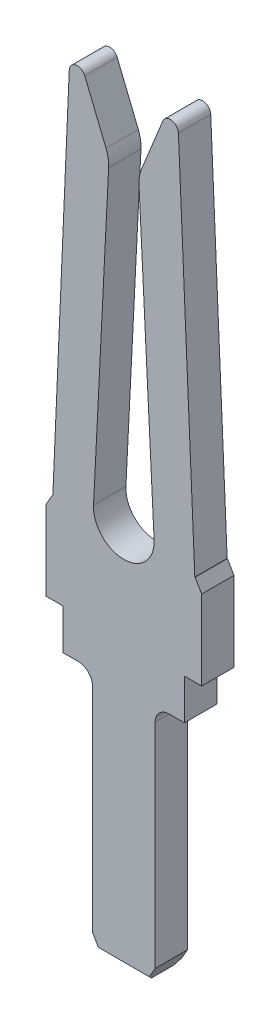
ISO-10303-21;
HEADER;
FILE_DESCRIPTION(('STEP AP214'),'2;1');
FILE_NAME('part.step','',(''),(''),'','','');
FILE_SCHEMA(('AUTOMOTIVE_DESIGN { 1 0 10303 214 1 1 1 1 }'));
ENDSEC;
DATA;
#1=APPLICATION_CONTEXT('core data for automotive mechanical design processes');
#2=APPLICATION_PROTOCOL_DEFINITION('international standard','automotive_design',2000,#1);
#3=PRODUCT_CONTEXT('',#1,'mechanical');
#4=PRODUCT('Part','Part','',(#3));
#5=PRODUCT_RELATED_PRODUCT_CATEGORY('part','',(#4));
#6=PRODUCT_DEFINITION_FORMATION('','',#4);
#7=PRODUCT_DEFINITION_CONTEXT('part definition',#1,'design');
#8=PRODUCT_DEFINITION('design','',#6,#7);
#9=PRODUCT_DEFINITION_SHAPE('','',#8);
#10=(LENGTH_UNIT() NAMED_UNIT(*) SI_UNIT(.MILLI.,.METRE.));
#11=(NAMED_UNIT(*) PLANE_ANGLE_UNIT() SI_UNIT($,.RADIAN.));
#12=(NAMED_UNIT(*) SI_UNIT($,.STERADIAN.) SOLID_ANGLE_UNIT());
#13=UNCERTAINTY_MEASURE_WITH_UNIT(LENGTH_MEASURE(1.E-05),#10,'distance_accuracy_value','');
#14=(GEOMETRIC_REPRESENTATION_CONTEXT(3) GLOBAL_UNCERTAINTY_ASSIGNED_CONTEXT((#13)) GLOBAL_UNIT_ASSIGNED_CONTEXT((#10,
#11,#12)) REPRESENTATION_CONTEXT('',''));
#15=CARTESIAN_POINT('',(0.,0.,0.));
#16=DIRECTION('',(0.,0.,1.));
#17=DIRECTION('',(1.,0.,0.));
#18=AXIS2_PLACEMENT_3D('',#15,#16,#17);
#19=CARTESIAN_POINT('',(0.,-3.048,0.));
#20=DIRECTION('',(0.,1.,0.));
#21=DIRECTION('',(0.,0.,1.));
#22=AXIS2_PLACEMENT_3D('',#19,#20,#21);
#23=PLANE('',#22);
#24=DIRECTION('',(1.,0.,0.));
#25=VECTOR('',#24,1.);
#26=CARTESIAN_POINT('',(0.,-3.04799999964588,-0.139700000354116));
#27=LINE('',#26,#25);
#28=CARTESIAN_POINT('',(-0.283714775017793,-3.04799999917373,-0.139700000118038));
#29=VERTEX_POINT('',#28);
#30=CARTESIAN_POINT('',(0.283714774813344,-3.04799999917373,-0.139700000295097));
#31=VERTEX_POINT('',#30);
#32=EDGE_CURVE('E177',#29,#31,#27,.T.);
#33=ORIENTED_EDGE('',*,*,#32,.T.);
#34=DIRECTION('',(0.,0.,1.));
#35=VECTOR('',#34,1.);
#36=CARTESIAN_POINT('',(0.283714774813344,-3.04799999893765,0.));
#37=LINE('',#36,#35);
#38=CARTESIAN_POINT('',(0.283714775017793,-3.04799999917373,0.139700000118039));
#39=VERTEX_POINT('',#38);
#40=EDGE_CURVE('E340',#39,#31,#37,.F.);
#41=ORIENTED_EDGE('',*,*,#40,.F.);
#42=DIRECTION('',(1.,0.,0.));
#43=VECTOR('',#42,1.);
#44=CARTESIAN_POINT('',(0.,-3.04799999964588,0.139700000354116));
#45=LINE('',#44,#43);
#46=CARTESIAN_POINT('',(-0.28371477569929,-3.04799999940981,0.139700000354116));
#47=VERTEX_POINT('',#46);
#48=EDGE_CURVE('E186',#39,#47,#45,.F.);
#49=ORIENTED_EDGE('',*,*,#48,.T.);
#50=DIRECTION('',(0.,0.,1.));
#51=VECTOR('',#50,1.);
#52=CARTESIAN_POINT('',(-0.283714774813343,-3.04799999893765,0.));
#53=LINE('',#52,#51);
#54=EDGE_CURVE('E356',#47,#29,#53,.F.);
#55=ORIENTED_EDGE('',*,*,#54,.T.);
#56=EDGE_LOOP('',(#33,#41,#49,#55));
#57=FACE_BOUND('',#56,.T.);
#58=ADVANCED_FACE('F16',(#57),#23,.F.);
#59=CARTESIAN_POINT('',(0.,-3.01625,-0.17145));
#60=DIRECTION('',(0.,0.707106781186548,0.707106781186548));
#61=DIRECTION('',(0.,-0.707106781186548,0.707106781186548));
#62=AXIS2_PLACEMENT_3D('',#59,#60,#61);
#63=PLANE('',#62);
#64=ORIENTED_EDGE('',*,*,#32,.F.);
#65=DIRECTION('',(-0.377964471826341,0.654653671519875,-0.654653670579019));
#66=VECTOR('',#65,1.);
#67=CARTESIAN_POINT('',(-0.283714774813344,-3.04799999893765,-0.1397));
#68=LINE('',#67,#66);
#69=CARTESIAN_POINT('',(-0.320376517025292,-2.98449999897683,-0.2032));
#70=VERTEX_POINT('',#69);
#71=EDGE_CURVE('E358',#29,#70,#68,.T.);
#72=ORIENTED_EDGE('',*,*,#71,.T.);
#73=DIRECTION('',(1.,0.,0.));
#74=VECTOR('',#73,1.);
#75=CARTESIAN_POINT('',(0.,-2.9844999992377,-0.2032));
#76=LINE('',#75,#74);
#77=CARTESIAN_POINT('',(0.320376516629927,-2.98449999917248,-0.2032));
#78=VERTEX_POINT('',#77);
#79=EDGE_CURVE('E262',#70,#78,#76,.T.);
#80=ORIENTED_EDGE('',*,*,#79,.T.);
#81=DIRECTION('',(0.377964471755182,0.654653671396623,-0.654653670743355));
#82=VECTOR('',#81,1.);
#83=CARTESIAN_POINT('',(0.283714774660007,-3.04799999920324,-0.1397));
#84=LINE('',#83,#82);
#85=EDGE_CURVE('E332',#31,#78,#84,.T.);
#86=ORIENTED_EDGE('',*,*,#85,.F.);
#87=EDGE_LOOP('',(#64,#72,#80,#86));
#88=FACE_BOUND('',#87,.T.);
#89=ADVANCED_FACE('F937',(#88),#63,.F.);
#90=CARTESIAN_POINT('',(0.,1.74640488931151,-0.2032));
#91=DIRECTION('',(0.,0.,1.));
#92=DIRECTION('',(1.,0.,0.));
#93=AXIS2_PLACEMENT_3D('',#90,#91,#92);
#94=PLANE('',#93);
#95=DIRECTION('',(1.,0.,0.));
#96=VECTOR('',#95,1.);
#97=CARTESIAN_POINT('',(-0.8938587533,1.651,-0.2032));
#98=LINE('',#97,#96);
#99=CARTESIAN_POINT('',(-0.892048000003553,1.65099999940063,-0.2032));
#100=VERTEX_POINT('',#99);
#101=CARTESIAN_POINT('',(-0.895669507755047,1.65099999883827,-0.2032));
#102=VERTEX_POINT('',#101);
#103=EDGE_CURVE('E259',#100,#102,#98,.F.);
#104=ORIENTED_EDGE('',*,*,#103,.F.);
#105=DIRECTION('',(0.0435939688754908,0.999049331053118,0.));
#106=VECTOR('',#105,1.);
#107=CARTESIAN_POINT('',(-0.7888757019,4.0154145752,-0.2032));
#108=LINE('',#107,#106);
#109=CARTESIAN_POINT('',(-0.685703403955362,6.37982914683937,-0.2032));
#110=VERTEX_POINT('',#109);
#111=EDGE_CURVE('E254',#100,#110,#108,.T.);
#112=ORIENTED_EDGE('',*,*,#111,.T.);
#113=CARTESIAN_POINT('',(-0.5842,6.3754,-0.2032));
#114=DIRECTION('',(0.,0.,-1.));
#115=DIRECTION('',(-1.,0.,0.));
#116=AXIS2_PLACEMENT_3D('',#113,#114,#115);
#117=CIRCLE('',#116,0.1016);
#118=CARTESIAN_POINT('',(-0.490093234634906,6.4136946169262,-0.2032));
#119=VERTEX_POINT('',#118);
#120=EDGE_CURVE('E413',#119,#110,#117,.F.);
#121=ORIENTED_EDGE('',*,*,#120,.F.);
#122=DIRECTION('',(-0.376915510328809,0.926247644031322,0.));
#123=VECTOR('',#122,1.);
#124=CARTESIAN_POINT('',(-0.3571563977,6.0870101907,-0.2032));
#125=LINE('',#124,#123);
#126=CARTESIAN_POINT('',(-0.224219569838039,5.76032577406583,-0.2032));
#127=VERTEX_POINT('',#126);
#128=EDGE_CURVE('E265',#127,#119,#125,.T.);
#129=ORIENTED_EDGE('',*,*,#128,.F.);
#130=CARTESIAN_POINT('',(-0.6477,5.588,-0.2032));
#131=DIRECTION('',(0.,0.,-1.));
#132=DIRECTION('',(-1.,0.,0.));
#133=AXIS2_PLACEMENT_3D('',#130,#131,#132);
#134=CIRCLE('',#133,0.4572);
#135=CARTESIAN_POINT('',(-0.191076780215661,5.56504194898683,-0.2032));
#136=VERTEX_POINT('',#135);
#137=EDGE_CURVE('E415',#136,#127,#134,.F.);
#138=ORIENTED_EDGE('',*,*,#137,.F.);
#139=DIRECTION('',(0.0502144612300115,0.998738458197831,0.));
#140=VECTOR('',#139,1.);
#141=CARTESIAN_POINT('',(-0.2857980695,3.6810868339,-0.2032));
#142=LINE('',#141,#140);
#143=CARTESIAN_POINT('',(-0.380519355868454,1.79713171043837,-0.2032));
#144=VERTEX_POINT('',#143);
#145=EDGE_CURVE('E269',#144,#136,#142,.T.);
#146=ORIENTED_EDGE('',*,*,#145,.F.);
#147=CARTESIAN_POINT('',(0.,1.778,-0.2032));
#148=DIRECTION('',(0.,0.,1.));
#149=DIRECTION('',(1.,0.,0.));
#150=AXIS2_PLACEMENT_3D('',#147,#148,#149);
#151=CIRCLE('',#150,0.381);
#152=CARTESIAN_POINT('',(0.38051935421113,1.7971317102781,-0.2032));
#153=VERTEX_POINT('',#152);
#154=EDGE_CURVE('E417',#144,#153,#151,.T.);
#155=ORIENTED_EDGE('',*,*,#154,.T.);
#156=DIRECTION('',(-0.0502144612300115,0.998738458197831,0.));
#157=VECTOR('',#156,1.);
#158=CARTESIAN_POINT('',(0.2857980695,3.6810868339,-0.2032));
#159=LINE('',#158,#157);
#160=CARTESIAN_POINT('',(0.191076783539906,5.56504194923955,-0.2032));
#161=VERTEX_POINT('',#160);
#162=EDGE_CURVE('E273',#153,#161,#159,.T.);
#163=ORIENTED_EDGE('',*,*,#162,.T.);
#164=CARTESIAN_POINT('',(0.6477,5.588,-0.2032));
#165=DIRECTION('',(0.,0.,-1.));
#166=DIRECTION('',(-1.,0.,0.));
#167=AXIS2_PLACEMENT_3D('',#164,#165,#166);
#168=CIRCLE('',#167,0.4572);
#169=CARTESIAN_POINT('',(0.224219573564484,5.76032577286862,-0.2032));
#170=VERTEX_POINT('',#169);
#171=EDGE_CURVE('E276',#170,#161,#168,.F.);
#172=ORIENTED_EDGE('',*,*,#171,.F.);
#173=DIRECTION('',(0.376915510328809,0.926247644031322,0.));
#174=VECTOR('',#173,1.);
#175=CARTESIAN_POINT('',(0.3571563977,6.0870101907,-0.2032));
#176=LINE('',#175,#174);
#177=CARTESIAN_POINT('',(0.490093230090947,6.41369461846389,-0.2032));
#178=VERTEX_POINT('',#177);
#179=EDGE_CURVE('E277',#170,#178,#176,.T.);
#180=ORIENTED_EDGE('',*,*,#179,.T.);
#181=CARTESIAN_POINT('',(0.5842,6.3754,-0.2032));
#182=DIRECTION('',(0.,0.,-1.));
#183=DIRECTION('',(-1.,0.,0.));
#184=AXIS2_PLACEMENT_3D('',#181,#182,#183);
#185=CIRCLE('',#184,0.1016);
#186=CARTESIAN_POINT('',(0.685703407984071,6.37982914729314,-0.2032));
#187=VERTEX_POINT('',#186);
#188=EDGE_CURVE('E280',#187,#178,#185,.F.);
#189=ORIENTED_EDGE('',*,*,#188,.F.);
#190=DIRECTION('',(-0.0435939688754908,0.999049331053118,0.));
#191=VECTOR('',#190,1.);
#192=CARTESIAN_POINT('',(0.7888757019,4.0154145752,-0.2032));
#193=LINE('',#192,#191);
#194=CARTESIAN_POINT('',(0.892048000058918,1.65099999909995,-0.2032));
#195=VERTEX_POINT('',#194);
#196=EDGE_CURVE('E281',#195,#187,#193,.T.);
#197=ORIENTED_EDGE('',*,*,#196,.F.);
#198=DIRECTION('',(1.,0.,0.));
#199=VECTOR('',#198,1.);
#200=CARTESIAN_POINT('',(0.8938587533,1.651,-0.2032));
#201=LINE('',#200,#199);
#202=CARTESIAN_POINT('',(0.895669507857299,1.65099999975803,-0.2032));
#203=VERTEX_POINT('',#202);
#204=EDGE_CURVE('E287',#203,#195,#201,.F.);
#205=ORIENTED_EDGE('',*,*,#204,.F.);
#206=DIRECTION('',(-0.500000043970481,0.866025378398068,0.));
#207=VECTOR('',#206,1.);
#208=CARTESIAN_POINT('',(0.9367847533,1.5797863121,-0.2032));
#209=LINE('',#208,#207);
#210=CARTESIAN_POINT('',(0.977900001395054,1.50857262057555,-0.2032));
#211=VERTEX_POINT('',#210);
#212=EDGE_CURVE('E294',#211,#203,#209,.T.);
#213=ORIENTED_EDGE('',*,*,#212,.F.);
#214=DIRECTION('',(0.,1.,0.));
#215=VECTOR('',#214,1.);
#216=CARTESIAN_POINT('',(0.9779,1.0082863121,-0.2032));
#217=LINE('',#216,#215);
#218=CARTESIAN_POINT('',(0.9779,0.50800000024638,-0.2032));
#219=VERTEX_POINT('',#218);
#220=EDGE_CURVE('E297',#219,#211,#217,.T.);
#221=ORIENTED_EDGE('',*,*,#220,.F.);
#222=DIRECTION('',(1.,0.,0.));
#223=VECTOR('',#222,1.);
#224=CARTESIAN_POINT('',(0.86995,0.508,-0.2032));
#225=LINE('',#224,#223);
#226=CARTESIAN_POINT('',(0.762000000112889,0.508,-0.2032));
#227=VERTEX_POINT('',#226);
#228=EDGE_CURVE('E305',#219,#227,#225,.F.);
#229=ORIENTED_EDGE('',*,*,#228,.T.);
#230=DIRECTION('',(0.,1.,0.));
#231=VECTOR('',#230,1.);
#232=CARTESIAN_POINT('',(0.762,0.254,-0.2032));
#233=LINE('',#232,#231);
#234=CARTESIAN_POINT('',(0.762,2.87393553688916E-10,-0.2032));
#235=VERTEX_POINT('',#234);
#236=EDGE_CURVE('E312',#235,#227,#233,.T.);
#237=ORIENTED_EDGE('',*,*,#236,.F.);
#238=DIRECTION('',(1.,0.,0.));
#239=VECTOR('',#238,1.);
#240=CARTESIAN_POINT('',(0.66675,0.,-0.2032));
#241=LINE('',#240,#239);
#242=CARTESIAN_POINT('',(0.571499999969202,0.,-0.2032));
#243=VERTEX_POINT('',#242);
#244=EDGE_CURVE('E318',#235,#243,#241,.F.);
#245=ORIENTED_EDGE('',*,*,#244,.T.);
#246=CARTESIAN_POINT('',(0.5715,-0.1778,-0.2032));
#247=DIRECTION('',(0.,0.,-1.));
#248=DIRECTION('',(-1.,0.,0.));
#249=AXIS2_PLACEMENT_3D('',#246,#247,#248);
#250=CIRCLE('',#249,0.1778);
#251=CARTESIAN_POINT('',(0.3937,-0.1778,-0.2032));
#252=VERTEX_POINT('',#251);
#253=EDGE_CURVE('E424',#243,#252,#250,.F.);
#254=ORIENTED_EDGE('',*,*,#253,.T.);
#255=DIRECTION('',(0.,1.,0.));
#256=VECTOR('',#255,1.);
#257=CARTESIAN_POINT('',(0.3937,-1.51765,-0.2032));
#258=LINE('',#257,#256);
#259=CARTESIAN_POINT('',(0.393700000226937,-2.85749999855876,-0.2032));
#260=VERTEX_POINT('',#259);
#261=EDGE_CURVE('E323',#260,#252,#258,.T.);
#262=ORIENTED_EDGE('',*,*,#261,.F.);
#263=DIRECTION('',(0.499999998361318,0.866025404730532,0.));
#264=VECTOR('',#263,1.);
#265=CARTESIAN_POINT('',(0.3387073871,-2.95275,-0.2032));
#266=LINE('',#265,#264);
#267=EDGE_CURVE('E327',#78,#260,#266,.T.);
#268=ORIENTED_EDGE('',*,*,#267,.F.);
#269=ORIENTED_EDGE('',*,*,#79,.F.);
#270=DIRECTION('',(-0.499999998361318,0.866025404730532,0.));
#271=VECTOR('',#270,1.);
#272=CARTESIAN_POINT('',(-0.3387073871,-2.95275,-0.2032));
#273=LINE('',#272,#271);
#274=CARTESIAN_POINT('',(-0.393700000386288,-2.8574999989964,-0.2032));
#275=VERTEX_POINT('',#274);
#276=EDGE_CURVE('E366',#70,#275,#273,.T.);
#277=ORIENTED_EDGE('',*,*,#276,.T.);
#278=DIRECTION('',(0.,1.,0.));
#279=VECTOR('',#278,1.);
#280=CARTESIAN_POINT('',(-0.3937,-1.51765,-0.2032));
#281=LINE('',#280,#279);
#282=CARTESIAN_POINT('',(-0.3937,-0.177800000289516,-0.2032));
#283=VERTEX_POINT('',#282);
#284=EDGE_CURVE('E128',#275,#283,#281,.T.);
#285=ORIENTED_EDGE('',*,*,#284,.T.);
#286=CARTESIAN_POINT('',(-0.5715,-0.1778,-0.2032));
#287=DIRECTION('',(0.,0.,-1.));
#288=DIRECTION('',(-1.,0.,0.));
#289=AXIS2_PLACEMENT_3D('',#286,#287,#288);
#290=CIRCLE('',#289,0.1778);
#291=CARTESIAN_POINT('',(-0.571499999963107,0.,-0.2032));
#292=VERTEX_POINT('',#291);
#293=EDGE_CURVE('E19',#283,#292,#290,.F.);
#294=ORIENTED_EDGE('',*,*,#293,.T.);
#295=DIRECTION('',(1.,0.,0.));
#296=VECTOR('',#295,1.);
#297=CARTESIAN_POINT('',(-0.66675,0.,-0.2032));
#298=LINE('',#297,#296);
#299=CARTESIAN_POINT('',(-0.762000000112889,0.,-0.2032));
#300=VERTEX_POINT('',#299);
#301=EDGE_CURVE('E138',#292,#300,#298,.F.);
#302=ORIENTED_EDGE('',*,*,#301,.T.);
#303=DIRECTION('',(0.,1.,0.));
#304=VECTOR('',#303,1.);
#305=CARTESIAN_POINT('',(-0.762,0.254,-0.2032));
#306=LINE('',#305,#304);
#307=CARTESIAN_POINT('',(-0.762,0.508000000164253,-0.2032));
#308=VERTEX_POINT('',#307);
#309=EDGE_CURVE('E212',#300,#308,#306,.T.);
#310=ORIENTED_EDGE('',*,*,#309,.T.);
#311=DIRECTION('',(1.,0.,0.));
#312=VECTOR('',#311,1.);
#313=CARTESIAN_POINT('',(-0.86995,0.508,-0.2032));
#314=LINE('',#313,#312);
#315=CARTESIAN_POINT('',(-0.9779,0.508,-0.2032));
#316=VERTEX_POINT('',#315);
#317=EDGE_CURVE('E211',#308,#316,#314,.F.);
#318=ORIENTED_EDGE('',*,*,#317,.T.);
#319=DIRECTION('',(0.,1.,0.));
#320=VECTOR('',#319,1.);
#321=CARTESIAN_POINT('',(-0.9779,1.0082863121,-0.2032));
#322=LINE('',#321,#320);
#323=CARTESIAN_POINT('',(-0.977900000581273,1.50857262050843,-0.2032));
#324=VERTEX_POINT('',#323);
#325=EDGE_CURVE('E242',#316,#324,#322,.T.);
#326=ORIENTED_EDGE('',*,*,#325,.T.);
#327=DIRECTION('',(0.500000043970481,0.866025378398068,0.));
#328=VECTOR('',#327,1.);
#329=CARTESIAN_POINT('',(-0.9367847533,1.5797863121,-0.2032));
#330=LINE('',#329,#328);
#331=EDGE_CURVE('E251',#324,#102,#330,.T.);
#332=ORIENTED_EDGE('',*,*,#331,.T.);
#333=EDGE_LOOP('',(#104,#112,#121,#129,#138,#146,#155,#163,#172,#180,#189,#197,#205,#213,#221,
#229,#237,#245,#254,#262,#268,#269,#277,#285,#294,#302,#310,#318,#326,#332));
#334=FACE_BOUND('',#333,.T.);
#335=ADVANCED_FACE('F640',(#334),#94,.F.);
#336=CARTESIAN_POINT('',(-0.8938587533,1.651,0.));
#337=DIRECTION('',(0.,1.,0.));
#338=DIRECTION('',(0.,0.,1.));
#339=AXIS2_PLACEMENT_3D('',#336,#337,#338);
#340=PLANE('',#339);
#341=DIRECTION('',(1.,0.,0.));
#342=VECTOR('',#341,1.);
#343=CARTESIAN_POINT('',(0.,1.65099999909627,0.2032));
#344=LINE('',#343,#342);
#345=CARTESIAN_POINT('',(-0.892047999967868,1.65099999909782,0.2032));
#346=VERTEX_POINT('',#345);
#347=CARTESIAN_POINT('',(-0.895669507990967,1.65099999881664,0.2032));
#348=VERTEX_POINT('',#347);
#349=EDGE_CURVE('E246',#346,#348,#344,.F.);
#350=ORIENTED_EDGE('',*,*,#349,.F.);
#351=DIRECTION('',(0.,0.,1.));
#352=VECTOR('',#351,1.);
#353=CARTESIAN_POINT('',(-0.892048000039238,1.65099999910094,0.));
#354=LINE('',#353,#352);
#355=EDGE_CURVE('E256',#346,#100,#354,.F.);
#356=ORIENTED_EDGE('',*,*,#355,.T.);
#357=ORIENTED_EDGE('',*,*,#103,.T.);
#358=DIRECTION('',(0.,0.,1.));
#359=VECTOR('',#358,1.);
#360=CARTESIAN_POINT('',(-0.895669507606089,1.6509999982574,0.));
#361=LINE('',#360,#359);
#362=EDGE_CURVE('E249',#102,#348,#361,.T.);
#363=ORIENTED_EDGE('',*,*,#362,.T.);
#364=EDGE_LOOP('',(#350,#356,#357,#363));
#365=FACE_BOUND('',#364,.T.);
#366=ADVANCED_FACE('F626',(#365),#340,.T.);
#367=CARTESIAN_POINT('',(-0.9367847533,1.5797863121,0.));
#368=DIRECTION('',(0.866025378398068,-0.500000043970481,0.));
#369=DIRECTION('',(0.500000043970481,0.866025378398068,0.));
#370=AXIS2_PLACEMENT_3D('',#367,#368,#369);
#371=PLANE('',#370);
#372=ORIENTED_EDGE('',*,*,#331,.F.);
#373=DIRECTION('',(0.,0.,-1.));
#374=VECTOR('',#373,1.);
#375=CARTESIAN_POINT('',(-0.9779,1.50857262017283,0.));
#376=LINE('',#375,#374);
#377=CARTESIAN_POINT('',(-0.977900000406891,1.50857262013927,0.2032));
#378=VERTEX_POINT('',#377);
#379=EDGE_CURVE('E240',#324,#378,#376,.F.);
#380=ORIENTED_EDGE('',*,*,#379,.T.);
#381=DIRECTION('',(-0.500000031176611,-0.866025385784614,0.));
#382=VECTOR('',#381,1.);
#383=CARTESIAN_POINT('',(-0.895669508108822,1.65099999922545,0.2032));
#384=LINE('',#383,#382);
#385=EDGE_CURVE('E227',#348,#378,#384,.T.);
#386=ORIENTED_EDGE('',*,*,#385,.F.);
#387=ORIENTED_EDGE('',*,*,#362,.F.);
#388=EDGE_LOOP('',(#372,#380,#386,#387));
#389=FACE_BOUND('',#388,.T.);
#390=ADVANCED_FACE('F643',(#389),#371,.F.);
#391=CARTESIAN_POINT('',(-0.9779,1.0082863121,0.));
#392=DIRECTION('',(1.,0.,0.));
#393=DIRECTION('',(0.,0.,-1.));
#394=AXIS2_PLACEMENT_3D('',#391,#392,#393);
#395=PLANE('',#394);
#396=DIRECTION('',(0.,1.,0.));
#397=VECTOR('',#396,1.);
#398=CARTESIAN_POINT('',(-0.977900000610336,1.74640488931151,0.2032));
#399=LINE('',#398,#397);
#400=CARTESIAN_POINT('',(-0.977900000406891,0.508000000164253,0.2032));
#401=VERTEX_POINT('',#400);
#402=EDGE_CURVE('E225',#378,#401,#399,.F.);
#403=ORIENTED_EDGE('',*,*,#402,.F.);
#404=ORIENTED_EDGE('',*,*,#379,.F.);
#405=ORIENTED_EDGE('',*,*,#325,.F.);
#406=DIRECTION('',(0.,0.,1.));
#407=VECTOR('',#406,1.);
#408=CARTESIAN_POINT('',(-0.9779,0.508,0.));
#409=LINE('',#408,#407);
#410=EDGE_CURVE('E234',#316,#401,#409,.T.);
#411=ORIENTED_EDGE('',*,*,#410,.T.);
#412=EDGE_LOOP('',(#403,#404,#405,#411));
#413=FACE_BOUND('',#412,.T.);
#414=ADVANCED_FACE('F647',(#413),#395,.F.);
#415=CARTESIAN_POINT('',(-0.86995,0.508,0.));
#416=DIRECTION('',(0.,1.,0.));
#417=DIRECTION('',(0.,0.,1.));
#418=AXIS2_PLACEMENT_3D('',#415,#416,#417);
#419=PLANE('',#418);
#420=ORIENTED_EDGE('',*,*,#317,.F.);
#421=DIRECTION('',(0.,0.,-1.));
#422=VECTOR('',#421,1.);
#423=CARTESIAN_POINT('',(-0.762,0.50800000024638,0.));
#424=LINE('',#423,#422);
#425=CARTESIAN_POINT('',(-0.762000000112889,0.50800000024638,0.2032));
#426=VERTEX_POINT('',#425);
#427=EDGE_CURVE('E205',#308,#426,#424,.F.);
#428=ORIENTED_EDGE('',*,*,#427,.T.);
#429=DIRECTION('',(1.,0.,0.));
#430=VECTOR('',#429,1.);
#431=CARTESIAN_POINT('',(0.,0.50800000024638,0.2032));
#432=LINE('',#431,#430);
#433=EDGE_CURVE('E209',#401,#426,#432,.T.);
#434=ORIENTED_EDGE('',*,*,#433,.F.);
#435=ORIENTED_EDGE('',*,*,#410,.F.);
#436=EDGE_LOOP('',(#420,#428,#434,#435));
#437=FACE_BOUND('',#436,.T.);
#438=ADVANCED_FACE('F206',(#437),#419,.F.);
#439=CARTESIAN_POINT('',(-0.762,0.254,0.));
#440=DIRECTION('',(1.,0.,0.));
#441=DIRECTION('',(0.,0.,-1.));
#442=AXIS2_PLACEMENT_3D('',#439,#440,#441);
#443=PLANE('',#442);
#444=ORIENTED_EDGE('',*,*,#309,.F.);
#445=DIRECTION('',(0.,0.,1.));
#446=VECTOR('',#445,1.);
#447=CARTESIAN_POINT('',(-0.762000000169333,0.,0.));
#448=LINE('',#447,#446);
#449=CARTESIAN_POINT('',(-0.762000000169333,1.91595726552659E-10,0.2032));
#450=VERTEX_POINT('',#449);
#451=EDGE_CURVE('E198',#300,#450,#448,.T.);
#452=ORIENTED_EDGE('',*,*,#451,.T.);
#453=DIRECTION('',(0.,1.,0.));
#454=VECTOR('',#453,1.);
#455=CARTESIAN_POINT('',(-0.762000000169333,1.74640488931151,0.2032));
#456=LINE('',#455,#454);
#457=EDGE_CURVE('E215',#426,#450,#456,.F.);
#458=ORIENTED_EDGE('',*,*,#457,.F.);
#459=ORIENTED_EDGE('',*,*,#427,.F.);
#460=EDGE_LOOP('',(#444,#452,#458,#459));
#461=FACE_BOUND('',#460,.T.);
#462=ADVANCED_FACE('F216',(#461),#443,.F.);
#463=CARTESIAN_POINT('',(-0.66675,0.,0.));
#464=DIRECTION('',(0.,1.,0.));
#465=DIRECTION('',(0.,0.,1.));
#466=AXIS2_PLACEMENT_3D('',#463,#464,#465);
#467=PLANE('',#466);
#468=DIRECTION('',(1.,0.,0.));
#469=VECTOR('',#468,1.);
#470=CARTESIAN_POINT('',(0.,2.87393589828988E-10,0.2032));
#471=LINE('',#470,#469);
#472=CARTESIAN_POINT('',(-0.571499999963107,1.43696794914494E-10,0.2032));
#473=VERTEX_POINT('',#472);
#474=EDGE_CURVE('E219',#450,#473,#471,.T.);
#475=ORIENTED_EDGE('',*,*,#474,.F.);
#476=ORIENTED_EDGE('',*,*,#451,.F.);
#477=ORIENTED_EDGE('',*,*,#301,.F.);
#478=DIRECTION('',(0.,0.,-1.));
#479=VECTOR('',#478,1.);
#480=CARTESIAN_POINT('',(-0.571499999926213,0.,0.2032));
#481=LINE('',#480,#479);
#482=EDGE_CURVE('E363',#292,#473,#481,.F.);
#483=ORIENTED_EDGE('',*,*,#482,.T.);
#484=EDGE_LOOP('',(#475,#476,#477,#483));
#485=FACE_BOUND('',#484,.T.);
#486=ADVANCED_FACE('F472',(#485),#467,.F.);
#487=CARTESIAN_POINT('',(-0.5715,-0.1778,0.2032));
#488=DIRECTION('',(0.,0.,-1.));
#489=DIRECTION('',(-1.,0.,0.));
#490=AXIS2_PLACEMENT_3D('',#487,#488,#489);
#491=CYLINDRICAL_SURFACE('',#490,0.1778);
#492=ORIENTED_EDGE('',*,*,#293,.F.);
#493=DIRECTION('',(0.,0.,-1.));
#494=VECTOR('',#493,1.);
#495=CARTESIAN_POINT('',(-0.3937,-0.177800000579031,0.));
#496=LINE('',#495,#494);
#497=CARTESIAN_POINT('',(-0.393699999951295,-0.177800000289516,0.2032));
#498=VERTEX_POINT('',#497);
#499=EDGE_CURVE('E359',#283,#498,#496,.F.);
#500=ORIENTED_EDGE('',*,*,#499,.T.);
#501=CARTESIAN_POINT('',(-0.5715,-0.1778,0.2032));
#502=DIRECTION('',(0.,0.,-1.));
#503=DIRECTION('',(-1.,0.,0.));
#504=AXIS2_PLACEMENT_3D('',#501,#502,#503);
#505=CIRCLE('',#504,0.1778);
#506=EDGE_CURVE('E409',#473,#498,#505,.T.);
#507=ORIENTED_EDGE('',*,*,#506,.F.);
#508=ORIENTED_EDGE('',*,*,#482,.F.);
#509=EDGE_LOOP('',(#492,#500,#507,#508));
#510=FACE_BOUND('',#509,.T.);
#511=ADVANCED_FACE('F474',(#510),#491,.F.);
#512=CARTESIAN_POINT('',(-0.3937,-1.51765,0.));
#513=DIRECTION('',(1.,0.,0.));
#514=DIRECTION('',(0.,0.,-1.));
#515=AXIS2_PLACEMENT_3D('',#512,#513,#514);
#516=PLANE('',#515);
#517=DIRECTION('',(0.,1.,0.));
#518=VECTOR('',#517,1.);
#519=CARTESIAN_POINT('',(-0.393699999902591,1.74640488931151,0.2032));
#520=LINE('',#519,#518);
#521=CARTESIAN_POINT('',(-0.393700000128203,-2.8574999989292,0.2032));
#522=VERTEX_POINT('',#521);
#523=EDGE_CURVE('E412',#498,#522,#520,.F.);
#524=ORIENTED_EDGE('',*,*,#523,.F.);
#525=ORIENTED_EDGE('',*,*,#499,.F.);
#526=ORIENTED_EDGE('',*,*,#284,.F.);
#527=DIRECTION('',(0.,0.,1.));
#528=VECTOR('',#527,1.);
#529=CARTESIAN_POINT('',(-0.393700000579432,-2.8574999989964,0.));
#530=LINE('',#529,#528);
#531=EDGE_CURVE('E353',#275,#522,#530,.T.);
#532=ORIENTED_EDGE('',*,*,#531,.T.);
#533=EDGE_LOOP('',(#524,#525,#526,#532));
#534=FACE_BOUND('',#533,.T.);
#535=ADVANCED_FACE('F582',(#534),#516,.F.);
#536=CARTESIAN_POINT('',(-0.3387073871,-2.95275,0.));
#537=DIRECTION('',(0.866025404730532,0.499999998361318,0.));
#538=DIRECTION('',(-0.499999998361318,0.866025404730532,0.));
#539=AXIS2_PLACEMENT_3D('',#536,#537,#538);
#540=PLANE('',#539);
#541=ORIENTED_EDGE('',*,*,#531,.F.);
#542=ORIENTED_EDGE('',*,*,#276,.F.);
#543=ORIENTED_EDGE('',*,*,#71,.F.);
#544=ORIENTED_EDGE('',*,*,#54,.F.);
#545=DIRECTION('',(-0.377964480142111,0.654653668648891,0.654653668648891));
#546=VECTOR('',#545,1.);
#547=CARTESIAN_POINT('',(-0.283714776040039,-3.04799999982294,0.139700000177058));
#548=LINE('',#547,#546);
#549=CARTESIAN_POINT('',(-0.320376518832955,-2.98450000001419,0.203199999997097));
#550=VERTEX_POINT('',#549);
#551=EDGE_CURVE('E352',#47,#550,#548,.T.);
#552=ORIENTED_EDGE('',*,*,#551,.T.);
#553=DIRECTION('',(0.499999980746742,-0.866025414900312,0.));
#554=VECTOR('',#553,1.);
#555=CARTESIAN_POINT('',(-0.393700000080823,-2.85749999858688,0.2032));
#556=LINE('',#555,#554);
#557=EDGE_CURVE('E449',#522,#550,#556,.T.);
#558=ORIENTED_EDGE('',*,*,#557,.F.);
#559=EDGE_LOOP('',(#541,#542,#543,#544,#552,#558));
#560=FACE_BOUND('',#559,.T.);
#561=ADVANCED_FACE('F586',(#560),#540,.F.);
#562=CARTESIAN_POINT('',(0.,-3.01625,0.17145));
#563=DIRECTION('',(0.,0.707106781186548,-0.707106781186548));
#564=DIRECTION('',(0.,0.707106781186548,0.707106781186548));
#565=AXIS2_PLACEMENT_3D('',#562,#563,#564);
#566=PLANE('',#565);
#567=ORIENTED_EDGE('',*,*,#551,.F.);
#568=ORIENTED_EDGE('',*,*,#48,.F.);
#569=DIRECTION('',(-0.37796447182634,-0.654653671519873,-0.654653670579021));
#570=VECTOR('',#569,1.);
#571=CARTESIAN_POINT('',(0.320376516799369,-2.98449999884639,0.2032));
#572=LINE('',#571,#570);
#573=CARTESIAN_POINT('',(0.320376517511088,-2.98449999970064,0.20319999992611));
#574=VERTEX_POINT('',#573);
#575=EDGE_CURVE('E348',#574,#39,#572,.T.);
#576=ORIENTED_EDGE('',*,*,#575,.F.);
#577=DIRECTION('',(1.,0.,0.));
#578=VECTOR('',#577,1.);
#579=CARTESIAN_POINT('',(0.,-2.98450000001693,0.2032));
#580=LINE('',#579,#578);
#581=EDGE_CURVE('E440',#550,#574,#580,.T.);
#582=ORIENTED_EDGE('',*,*,#581,.F.);
#583=EDGE_LOOP('',(#567,#568,#576,#582));
#584=FACE_BOUND('',#583,.T.);
#585=ADVANCED_FACE('F591',(#584),#566,.F.);
#586=CARTESIAN_POINT('',(0.3387073871,-2.95275,0.));
#587=DIRECTION('',(0.866025404730532,-0.499999998361318,0.));
#588=DIRECTION('',(0.499999998361318,0.866025404730532,0.));
#589=AXIS2_PLACEMENT_3D('',#586,#587,#588);
#590=PLANE('',#589);
#591=ORIENTED_EDGE('',*,*,#85,.T.);
#592=ORIENTED_EDGE('',*,*,#267,.T.);
#593=DIRECTION('',(0.,0.,-1.));
#594=VECTOR('',#593,1.);
#595=CARTESIAN_POINT('',(0.3937,-2.85749999842774,0.));
#596=LINE('',#595,#594);
#597=CARTESIAN_POINT('',(0.393699999913414,-2.85749999842774,0.2032));
#598=VERTEX_POINT('',#597);
#599=EDGE_CURVE('E326',#598,#260,#596,.T.);
#600=ORIENTED_EDGE('',*,*,#599,.F.);
#601=DIRECTION('',(0.499999983811009,0.866025413131157,0.));
#602=VECTOR('',#601,1.);
#603=CARTESIAN_POINT('',(0.320376518154907,-2.98449999962901,0.2032));
#604=LINE('',#603,#602);
#605=EDGE_CURVE('E437',#574,#598,#604,.T.);
#606=ORIENTED_EDGE('',*,*,#605,.F.);
#607=ORIENTED_EDGE('',*,*,#575,.T.);
#608=ORIENTED_EDGE('',*,*,#40,.T.);
#609=EDGE_LOOP('',(#591,#592,#600,#606,#607,#608));
#610=FACE_BOUND('',#609,.T.);
#611=ADVANCED_FACE('F727',(#610),#590,.T.);
#612=CARTESIAN_POINT('',(0.3937,-1.51765,0.));
#613=DIRECTION('',(1.,0.,0.));
#614=DIRECTION('',(0.,0.,-1.));
#615=AXIS2_PLACEMENT_3D('',#612,#613,#614);
#616=PLANE('',#615);
#617=DIRECTION('',(0.,1.,0.));
#618=VECTOR('',#617,1.);
#619=CARTESIAN_POINT('',(0.393699999870121,1.74640488931151,0.2032));
#620=LINE('',#619,#618);
#621=CARTESIAN_POINT('',(0.393699999935061,-0.1778,0.2032));
#622=VERTEX_POINT('',#621);
#623=EDGE_CURVE('E408',#598,#622,#620,.T.);
#624=ORIENTED_EDGE('',*,*,#623,.F.);
#625=ORIENTED_EDGE('',*,*,#599,.T.);
#626=ORIENTED_EDGE('',*,*,#261,.T.);
#627=DIRECTION('',(0.,0.,-1.));
#628=VECTOR('',#627,1.);
#629=CARTESIAN_POINT('',(0.3937,-0.1778,0.2032));
#630=LINE('',#629,#628);
#631=EDGE_CURVE('E320',#252,#622,#630,.F.);
#632=ORIENTED_EDGE('',*,*,#631,.T.);
#633=EDGE_LOOP('',(#624,#625,#626,#632));
#634=FACE_BOUND('',#633,.T.);
#635=ADVANCED_FACE('F724',(#634),#616,.T.);
#636=CARTESIAN_POINT('',(0.5715,-0.1778,0.2032));
#637=DIRECTION('',(0.,0.,-1.));
#638=DIRECTION('',(-1.,0.,0.));
#639=AXIS2_PLACEMENT_3D('',#636,#637,#638);
#640=CYLINDRICAL_SURFACE('',#639,0.1778);
#641=ORIENTED_EDGE('',*,*,#253,.F.);
#642=DIRECTION('',(0.,0.,1.));
#643=VECTOR('',#642,1.);
#644=CARTESIAN_POINT('',(0.571499999938405,0.,0.));
#645=LINE('',#644,#643);
#646=CARTESIAN_POINT('',(0.571499999969202,1.07772514870708E-10,0.2032));
#647=VERTEX_POINT('',#646);
#648=EDGE_CURVE('E315',#243,#647,#645,.T.);
#649=ORIENTED_EDGE('',*,*,#648,.T.);
#650=CARTESIAN_POINT('',(0.5715,-0.1778,0.2032));
#651=DIRECTION('',(0.,0.,-1.));
#652=DIRECTION('',(-1.,0.,0.));
#653=AXIS2_PLACEMENT_3D('',#650,#651,#652);
#654=CIRCLE('',#653,0.1778);
#655=EDGE_CURVE('E404',#622,#647,#654,.T.);
#656=ORIENTED_EDGE('',*,*,#655,.F.);
#657=ORIENTED_EDGE('',*,*,#631,.F.);
#658=EDGE_LOOP('',(#641,#649,#656,#657));
#659=FACE_BOUND('',#658,.T.);
#660=ADVANCED_FACE('F564',(#659),#640,.F.);
#661=CARTESIAN_POINT('',(0.66675,0.,0.));
#662=DIRECTION('',(0.,1.,0.));
#663=DIRECTION('',(0.,0.,1.));
#664=AXIS2_PLACEMENT_3D('',#661,#662,#663);
#665=PLANE('',#664);
#666=ORIENTED_EDGE('',*,*,#244,.F.);
#667=DIRECTION('',(0.,0.,-1.));
#668=VECTOR('',#667,1.);
#669=CARTESIAN_POINT('',(0.762,4.31090330533374E-10,0.));
#670=LINE('',#669,#668);
#671=CARTESIAN_POINT('',(0.762000000112889,2.87393463338735E-10,0.2032));
#672=VERTEX_POINT('',#671);
#673=EDGE_CURVE('E309',#672,#235,#670,.T.);
#674=ORIENTED_EDGE('',*,*,#673,.F.);
#675=DIRECTION('',(1.,0.,0.));
#676=VECTOR('',#675,1.);
#677=CARTESIAN_POINT('',(0.,2.15545029741415E-10,0.2032));
#678=LINE('',#677,#676);
#679=EDGE_CURVE('E407',#647,#672,#678,.T.);
#680=ORIENTED_EDGE('',*,*,#679,.F.);
#681=ORIENTED_EDGE('',*,*,#648,.F.);
#682=EDGE_LOOP('',(#666,#674,#680,#681));
#683=FACE_BOUND('',#682,.T.);
#684=ADVANCED_FACE('F571',(#683),#665,.F.);
#685=CARTESIAN_POINT('',(0.762,0.254,0.));
#686=DIRECTION('',(1.,0.,0.));
#687=DIRECTION('',(0.,0.,-1.));
#688=AXIS2_PLACEMENT_3D('',#685,#686,#687);
#689=PLANE('',#688);
#690=DIRECTION('',(0.,1.,0.));
#691=VECTOR('',#690,1.);
#692=CARTESIAN_POINT('',(0.762000000169333,1.74640488931151,0.2032));
#693=LINE('',#692,#691);
#694=CARTESIAN_POINT('',(0.762000000169333,0.508000000164253,0.2032));
#695=VERTEX_POINT('',#694);
#696=EDGE_CURVE('E546',#672,#695,#693,.T.);
#697=ORIENTED_EDGE('',*,*,#696,.F.);
#698=ORIENTED_EDGE('',*,*,#673,.T.);
#699=ORIENTED_EDGE('',*,*,#236,.T.);
#700=DIRECTION('',(0.,0.,1.));
#701=VECTOR('',#700,1.);
#702=CARTESIAN_POINT('',(0.762000000169333,0.508,0.));
#703=LINE('',#702,#701);
#704=EDGE_CURVE('E308',#227,#695,#703,.T.);
#705=ORIENTED_EDGE('',*,*,#704,.T.);
#706=EDGE_LOOP('',(#697,#698,#699,#705));
#707=FACE_BOUND('',#706,.T.);
#708=ADVANCED_FACE('F715',(#707),#689,.T.);
#709=CARTESIAN_POINT('',(0.86995,0.508,0.));
#710=DIRECTION('',(0.,1.,0.));
#711=DIRECTION('',(0.,0.,1.));
#712=AXIS2_PLACEMENT_3D('',#709,#710,#711);
#713=PLANE('',#712);
#714=ORIENTED_EDGE('',*,*,#228,.F.);
#715=DIRECTION('',(0.,0.,-1.));
#716=VECTOR('',#715,1.);
#717=CARTESIAN_POINT('',(0.9779,0.50800000036957,0.));
#718=LINE('',#717,#716);
#719=CARTESIAN_POINT('',(0.9779,0.508000000287443,0.2032));
#720=VERTEX_POINT('',#719);
#721=EDGE_CURVE('E302',#720,#219,#718,.T.);
#722=ORIENTED_EDGE('',*,*,#721,.F.);
#723=DIRECTION('',(1.,0.,0.));
#724=VECTOR('',#723,1.);
#725=CARTESIAN_POINT('',(0.,0.50800000024638,0.2032));
#726=LINE('',#725,#724);
#727=EDGE_CURVE('E537',#695,#720,#726,.T.);
#728=ORIENTED_EDGE('',*,*,#727,.F.);
#729=ORIENTED_EDGE('',*,*,#704,.F.);
#730=EDGE_LOOP('',(#714,#722,#728,#729));
#731=FACE_BOUND('',#730,.T.);
#732=ADVANCED_FACE('F711',(#731),#713,.F.);
#733=CARTESIAN_POINT('',(0.9779,1.0082863121,0.));
#734=DIRECTION('',(1.,0.,0.));
#735=DIRECTION('',(0.,0.,-1.));
#736=AXIS2_PLACEMENT_3D('',#733,#734,#735);
#737=PLANE('',#736);
#738=ORIENTED_EDGE('',*,*,#220,.T.);
#739=DIRECTION('',(0.,0.,1.));
#740=VECTOR('',#739,1.);
#741=CARTESIAN_POINT('',(0.977900002092581,1.50857262057555,0.));
#742=LINE('',#741,#740);
#743=CARTESIAN_POINT('',(0.977900000697527,1.50857262084403,0.2032));
#744=VERTEX_POINT('',#743);
#745=EDGE_CURVE('E291',#744,#211,#742,.F.);
#746=ORIENTED_EDGE('',*,*,#745,.F.);
#747=DIRECTION('',(0.,1.,0.));
#748=VECTOR('',#747,1.);
#749=CARTESIAN_POINT('',(0.9779,1.74640488931151,0.2032));
#750=LINE('',#749,#748);
#751=EDGE_CURVE('E528',#720,#744,#750,.T.);
#752=ORIENTED_EDGE('',*,*,#751,.F.);
#753=ORIENTED_EDGE('',*,*,#721,.T.);
#754=EDGE_LOOP('',(#738,#746,#752,#753));
#755=FACE_BOUND('',#754,.T.);
#756=ADVANCED_FACE('F707',(#755),#737,.T.);
#757=CARTESIAN_POINT('',(0.9367847533,1.5797863121,0.));
#758=DIRECTION('',(0.866025378398068,0.500000043970481,0.));
#759=DIRECTION('',(-0.500000043970481,0.866025378398068,0.));
#760=AXIS2_PLACEMENT_3D('',#757,#758,#759);
#761=PLANE('',#760);
#762=DIRECTION('',(-0.500000030222362,0.866025386335549,0.));
#763=VECTOR('',#762,1.);
#764=CARTESIAN_POINT('',(0.977900000697527,1.50857261977011,0.2032));
#765=LINE('',#764,#763);
#766=CARTESIAN_POINT('',(0.8956695082764,1.65099999939751,0.2032));
#767=VERTEX_POINT('',#766);
#768=EDGE_CURVE('E519',#744,#767,#765,.T.);
#769=ORIENTED_EDGE('',*,*,#768,.F.);
#770=ORIENTED_EDGE('',*,*,#745,.T.);
#771=ORIENTED_EDGE('',*,*,#212,.T.);
#772=DIRECTION('',(0.,0.,1.));
#773=VECTOR('',#772,1.);
#774=CARTESIAN_POINT('',(0.8956695082764,1.651,0.));
#775=LINE('',#774,#773);
#776=EDGE_CURVE('E290',#767,#203,#775,.F.);
#777=ORIENTED_EDGE('',*,*,#776,.F.);
#778=EDGE_LOOP('',(#769,#770,#771,#777));
#779=FACE_BOUND('',#778,.T.);
#780=ADVANCED_FACE('F703',(#779),#761,.T.);
#781=CARTESIAN_POINT('',(0.8938587533,1.651,0.));
#782=DIRECTION('',(0.,1.,0.));
#783=DIRECTION('',(0.,0.,1.));
#784=AXIS2_PLACEMENT_3D('',#781,#782,#783);
#785=PLANE('',#784);
#786=DIRECTION('',(1.,0.,0.));
#787=VECTOR('',#786,1.);
#788=CARTESIAN_POINT('',(0.,1.65099999909627,0.2032));
#789=LINE('',#788,#787);
#790=CARTESIAN_POINT('',(0.8920479999895,1.65099999894749,0.2032));
#791=VERTEX_POINT('',#790);
#792=EDGE_CURVE('E516',#767,#791,#789,.F.);
#793=ORIENTED_EDGE('',*,*,#792,.F.);
#794=ORIENTED_EDGE('',*,*,#776,.T.);
#795=ORIENTED_EDGE('',*,*,#204,.T.);
#796=DIRECTION('',(0.,0.,1.));
#797=VECTOR('',#796,1.);
#798=CARTESIAN_POINT('',(0.892048000058918,1.65099999864993,0.));
#799=LINE('',#798,#797);
#800=EDGE_CURVE('E284',#791,#195,#799,.F.);
#801=ORIENTED_EDGE('',*,*,#800,.F.);
#802=EDGE_LOOP('',(#793,#794,#795,#801));
#803=FACE_BOUND('',#802,.T.);
#804=ADVANCED_FACE('F699',(#803),#785,.T.);
#805=CARTESIAN_POINT('',(0.7888757019,4.0154145752,0.));
#806=DIRECTION('',(0.999049331053118,0.0435939688754908,0.));
#807=DIRECTION('',(-0.0435939688754908,0.999049331053118,0.));
#808=AXIS2_PLACEMENT_3D('',#805,#806,#807);
#809=PLANE('',#808);
#810=ORIENTED_EDGE('',*,*,#196,.T.);
#811=DIRECTION('',(0.,0.,-1.));
#812=VECTOR('',#811,1.);
#813=CARTESIAN_POINT('',(0.685703412014775,6.37982914770117,0.2032));
#814=LINE('',#813,#812);
#815=CARTESIAN_POINT('',(0.685703411313202,6.37982914736597,0.2032));
#816=VERTEX_POINT('',#815);
#817=EDGE_CURVE('E283',#816,#187,#814,.T.);
#818=ORIENTED_EDGE('',*,*,#817,.F.);
#819=DIRECTION('',(-0.0435939674522969,0.99904933111522,0.));
#820=VECTOR('',#819,1.);
#821=CARTESIAN_POINT('',(0.892047999974428,1.65099999864625,0.2032));
#822=LINE('',#821,#820);
#823=EDGE_CURVE('E403',#791,#816,#822,.T.);
#824=ORIENTED_EDGE('',*,*,#823,.F.);
#825=ORIENTED_EDGE('',*,*,#800,.T.);
#826=EDGE_LOOP('',(#810,#818,#824,#825));
#827=FACE_BOUND('',#826,.T.);
#828=ADVANCED_FACE('F695',(#827),#809,.T.);
#829=CARTESIAN_POINT('',(0.5842,6.3754,0.2032));
#830=DIRECTION('',(0.,0.,-1.));
#831=DIRECTION('',(-1.,0.,0.));
#832=AXIS2_PLACEMENT_3D('',#829,#830,#831);
#833=CYLINDRICAL_SURFACE('',#832,0.1016);
#834=DIRECTION('',(0.,0.,1.));
#835=VECTOR('',#834,1.);
#836=CARTESIAN_POINT('',(0.490093229685985,6.41369461746872,0.));
#837=LINE('',#836,#835);
#838=CARTESIAN_POINT('',(0.490093232260252,6.41369461744293,0.2032));
#839=VERTEX_POINT('',#838);
#840=EDGE_CURVE('E279',#178,#839,#837,.T.);
#841=ORIENTED_EDGE('',*,*,#840,.T.);
#842=CARTESIAN_POINT('',(0.5842,6.3754,0.2032));
#843=DIRECTION('',(0.,0.,-1.));
#844=DIRECTION('',(-1.,0.,0.));
#845=AXIS2_PLACEMENT_3D('',#842,#843,#844);
#846=CIRCLE('',#845,0.1016);
#847=EDGE_CURVE('E400',#816,#839,#846,.F.);
#848=ORIENTED_EDGE('',*,*,#847,.F.);
#849=ORIENTED_EDGE('',*,*,#817,.T.);
#850=ORIENTED_EDGE('',*,*,#188,.T.);
#851=EDGE_LOOP('',(#841,#848,#849,#850));
#852=FACE_BOUND('',#851,.T.);
#853=ADVANCED_FACE('F691',(#852),#833,.T.);
#854=CARTESIAN_POINT('',(0.3571563977,6.0870101907,0.));
#855=DIRECTION('',(0.926247644031322,-0.376915510328809,0.));
#856=DIRECTION('',(0.376915510328809,0.926247644031322,0.));
#857=AXIS2_PLACEMENT_3D('',#854,#855,#856);
#858=PLANE('',#857);
#859=DIRECTION('',(-0.376915507994666,-0.926247644981148,0.));
#860=VECTOR('',#859,1.);
#861=CARTESIAN_POINT('',(0.490093234236475,6.41369461594748,0.2032));
#862=LINE('',#861,#860);
#863=CARTESIAN_POINT('',(0.224219576388154,5.76032577109765,0.2032));
#864=VERTEX_POINT('',#863);
#865=EDGE_CURVE('E399',#839,#864,#862,.T.);
#866=ORIENTED_EDGE('',*,*,#865,.F.);
#867=ORIENTED_EDGE('',*,*,#840,.F.);
#868=ORIENTED_EDGE('',*,*,#179,.F.);
#869=DIRECTION('',(0.,0.,-1.));
#870=VECTOR('',#869,1.);
#871=CARTESIAN_POINT('',(0.224219577210112,5.76032577147281,0.2032));
#872=LINE('',#871,#870);
#873=EDGE_CURVE('E422',#864,#170,#872,.T.);
#874=ORIENTED_EDGE('',*,*,#873,.F.);
#875=EDGE_LOOP('',(#866,#867,#868,#874));
#876=FACE_BOUND('',#875,.T.);
#877=ADVANCED_FACE('F687',(#876),#858,.F.);
#878=CARTESIAN_POINT('',(0.6477,5.588,0.2032));
#879=DIRECTION('',(0.,0.,-1.));
#880=DIRECTION('',(-1.,0.,0.));
#881=AXIS2_PLACEMENT_3D('',#878,#879,#880);
#882=CYLINDRICAL_SURFACE('',#881,0.4572);
#883=ORIENTED_EDGE('',*,*,#171,.T.);
#884=DIRECTION('',(0.,0.,1.));
#885=VECTOR('',#884,1.);
#886=CARTESIAN_POINT('',(0.191076783510785,5.56504194981876,0.));
#887=LINE('',#886,#885);
#888=CARTESIAN_POINT('',(0.191076781877525,5.56504194911843,0.2032));
#889=VERTEX_POINT('',#888);
#890=EDGE_CURVE('E275',#161,#889,#887,.T.);
#891=ORIENTED_EDGE('',*,*,#890,.T.);
#892=CARTESIAN_POINT('',(0.6477,5.588,0.2032));
#893=DIRECTION('',(0.,0.,-1.));
#894=DIRECTION('',(-1.,0.,0.));
#895=AXIS2_PLACEMENT_3D('',#892,#893,#894);
#896=CIRCLE('',#895,0.4572);
#897=EDGE_CURVE('E397',#864,#889,#896,.F.);
#898=ORIENTED_EDGE('',*,*,#897,.F.);
#899=ORIENTED_EDGE('',*,*,#873,.T.);
#900=EDGE_LOOP('',(#883,#891,#898,#899));
#901=FACE_BOUND('',#900,.T.);
#902=ADVANCED_FACE('F683',(#901),#882,.T.);
#903=CARTESIAN_POINT('',(0.2857980695,3.6810868339,0.));
#904=DIRECTION('',(0.998738458197831,0.0502144612300115,0.));
#905=DIRECTION('',(-0.0502144612300115,0.998738458197831,0.));
#906=AXIS2_PLACEMENT_3D('',#903,#904,#905);
#907=PLANE('',#906);
#908=DIRECTION('',(0.0502144613938064,-0.998738458189595,0.));
#909=VECTOR('',#908,1.);
#910=CARTESIAN_POINT('',(0.191076780196143,5.56504194937521,0.2032));
#911=LINE('',#910,#909);
#912=CARTESIAN_POINT('',(0.380519352854269,1.79713171024117,0.2032));
#913=VERTEX_POINT('',#912);
#914=EDGE_CURVE('E396',#889,#913,#911,.T.);
#915=ORIENTED_EDGE('',*,*,#914,.F.);
#916=ORIENTED_EDGE('',*,*,#890,.F.);
#917=ORIENTED_EDGE('',*,*,#162,.F.);
#918=DIRECTION('',(0.,0.,-1.));
#919=VECTOR('',#918,1.);
#920=CARTESIAN_POINT('',(0.38051935252652,1.79713171066053,0.2032));
#921=LINE('',#920,#919);
#922=EDGE_CURVE('E419',#153,#913,#921,.F.);
#923=ORIENTED_EDGE('',*,*,#922,.T.);
#924=EDGE_LOOP('',(#915,#916,#917,#923));
#925=FACE_BOUND('',#924,.T.);
#926=ADVANCED_FACE('F679',(#925),#907,.F.);
#927=CARTESIAN_POINT('',(0.,1.778,0.2032));
#928=DIRECTION('',(0.,0.,-1.));
#929=DIRECTION('',(-1.,0.,0.));
#930=AXIS2_PLACEMENT_3D('',#927,#928,#929);
#931=CYLINDRICAL_SURFACE('',#930,0.381);
#932=DIRECTION('',(0.,0.,1.));
#933=VECTOR('',#932,1.);
#934=CARTESIAN_POINT('',(-0.380519355841169,1.79713171098107,0.));
#935=LINE('',#934,#933);
#936=CARTESIAN_POINT('',(-0.380519355332119,1.7971317106438,0.2032));
#937=VERTEX_POINT('',#936);
#938=EDGE_CURVE('E272',#937,#144,#935,.F.);
#939=ORIENTED_EDGE('',*,*,#938,.F.);
#940=CARTESIAN_POINT('',(0.,1.778,0.2032));
#941=DIRECTION('',(0.,0.,1.));
#942=DIRECTION('',(1.,0.,0.));
#943=AXIS2_PLACEMENT_3D('',#940,#941,#942);
#944=CIRCLE('',#943,0.381);
#945=EDGE_CURVE('E394',#913,#937,#944,.F.);
#946=ORIENTED_EDGE('',*,*,#945,.F.);
#947=ORIENTED_EDGE('',*,*,#922,.F.);
#948=ORIENTED_EDGE('',*,*,#154,.F.);
#949=EDGE_LOOP('',(#939,#946,#947,#948));
#950=FACE_BOUND('',#949,.T.);
#951=ADVANCED_FACE('F675',(#950),#931,.F.);
#952=CARTESIAN_POINT('',(-0.2857980695,3.6810868339,0.));
#953=DIRECTION('',(0.998738458197831,-0.0502144612300115,0.));
#954=DIRECTION('',(0.0502144612300115,0.998738458197831,0.));
#955=AXIS2_PLACEMENT_3D('',#952,#953,#954);
#956=PLANE('',#955);
#957=DIRECTION('',(0.,0.,-1.));
#958=VECTOR('',#957,1.);
#959=CARTESIAN_POINT('',(-0.191076776862293,5.56504194931332,0.2032));
#960=LINE('',#959,#958);
#961=CARTESIAN_POINT('',(-0.191076777409626,5.56504194856688,0.2032));
#962=VERTEX_POINT('',#961);
#963=EDGE_CURVE('E271',#962,#136,#960,.T.);
#964=ORIENTED_EDGE('',*,*,#963,.F.);
#965=DIRECTION('',(0.0502144624468361,0.998738458136651,0.));
#966=VECTOR('',#965,1.);
#967=CARTESIAN_POINT('',(-0.380519354791806,1.79713171092831,0.2032));
#968=LINE('',#967,#966);
#969=EDGE_CURVE('E393',#937,#962,#968,.T.);
#970=ORIENTED_EDGE('',*,*,#969,.F.);
#971=ORIENTED_EDGE('',*,*,#938,.T.);
#972=ORIENTED_EDGE('',*,*,#145,.T.);
#973=EDGE_LOOP('',(#964,#970,#971,#972));
#974=FACE_BOUND('',#973,.T.);
#975=ADVANCED_FACE('F671',(#974),#956,.T.);
#976=CARTESIAN_POINT('',(-0.6477,5.588,0.2032));
#977=DIRECTION('',(0.,0.,-1.));
#978=DIRECTION('',(-1.,0.,0.));
#979=AXIS2_PLACEMENT_3D('',#976,#977,#978);
#980=CYLINDRICAL_SURFACE('',#979,0.4572);
#981=DIRECTION('',(0.,0.,1.));
#982=VECTOR('',#981,1.);
#983=CARTESIAN_POINT('',(-0.224219569757223,5.76032577386723,0.));
#984=LINE('',#983,#982);
#985=CARTESIAN_POINT('',(-0.224219572180434,5.76032577464473,0.2032));
#986=VERTEX_POINT('',#985);
#987=EDGE_CURVE('E268',#986,#127,#984,.F.);
#988=ORIENTED_EDGE('',*,*,#987,.F.);
#989=CARTESIAN_POINT('',(-0.6477,5.588,0.2032));
#990=DIRECTION('',(0.,0.,-1.));
#991=DIRECTION('',(-1.,0.,0.));
#992=AXIS2_PLACEMENT_3D('',#989,#990,#991);
#993=CIRCLE('',#992,0.4572);
#994=EDGE_CURVE('E390',#962,#986,#993,.F.);
#995=ORIENTED_EDGE('',*,*,#994,.F.);
#996=ORIENTED_EDGE('',*,*,#963,.T.);
#997=ORIENTED_EDGE('',*,*,#137,.T.);
#998=EDGE_LOOP('',(#988,#995,#996,#997));
#999=FACE_BOUND('',#998,.T.);
#1000=ADVANCED_FACE('F668',(#999),#980,.T.);
#1001=CARTESIAN_POINT('',(-0.3571563977,6.0870101907,0.));
#1002=DIRECTION('',(0.926247644031322,0.376915510328809,0.));
#1003=DIRECTION('',(-0.376915510328809,0.926247644031322,0.));
#1004=AXIS2_PLACEMENT_3D('',#1001,#1002,#1003);
#1005=PLANE('',#1004);
#1006=DIRECTION('',(0.,0.,-1.));
#1007=VECTOR('',#1006,1.);
#1008=CARTESIAN_POINT('',(-0.490093238773902,6.41369461439333,0.2032));
#1009=LINE('',#1008,#1007);
#1010=CARTESIAN_POINT('',(-0.490093238589262,6.41369461565753,0.2032));
#1011=VERTEX_POINT('',#1010);
#1012=EDGE_CURVE('E267',#1011,#119,#1009,.T.);
#1013=ORIENTED_EDGE('',*,*,#1012,.F.);
#1014=DIRECTION('',(-0.376915516078731,0.926247641691521,0.));
#1015=VECTOR('',#1014,1.);
#1016=CARTESIAN_POINT('',(-0.224219573372255,5.76032577239617,0.2032));
#1017=LINE('',#1016,#1015);
#1018=EDGE_CURVE('E389',#986,#1011,#1017,.T.);
#1019=ORIENTED_EDGE('',*,*,#1018,.F.);
#1020=ORIENTED_EDGE('',*,*,#987,.T.);
#1021=ORIENTED_EDGE('',*,*,#128,.T.);
#1022=EDGE_LOOP('',(#1013,#1019,#1020,#1021));
#1023=FACE_BOUND('',#1022,.T.);
#1024=ADVANCED_FACE('F637',(#1023),#1005,.T.);
#1025=CARTESIAN_POINT('',(-0.5842,6.3754,0.2032));
#1026=DIRECTION('',(0.,0.,-1.));
#1027=DIRECTION('',(-1.,0.,0.));
#1028=AXIS2_PLACEMENT_3D('',#1025,#1026,#1027);
#1029=CYLINDRICAL_SURFACE('',#1028,0.1016);
#1030=DIRECTION('',(0.,0.,1.));
#1031=VECTOR('',#1030,1.);
#1032=CARTESIAN_POINT('',(-0.685703403957357,6.37982914679364,0.));
#1033=LINE('',#1032,#1031);
#1034=CARTESIAN_POINT('',(-0.685703405977733,6.37982914688302,0.2032));
#1035=VERTEX_POINT('',#1034);
#1036=EDGE_CURVE('E34',#110,#1035,#1033,.T.);
#1037=ORIENTED_EDGE('',*,*,#1036,.T.);
#1038=CARTESIAN_POINT('',(-0.5842,6.3754,0.2032));
#1039=DIRECTION('',(0.,0.,-1.));
#1040=DIRECTION('',(-1.,0.,0.));
#1041=AXIS2_PLACEMENT_3D('',#1038,#1039,#1040);
#1042=CIRCLE('',#1041,0.1016);
#1043=EDGE_CURVE('E25',#1011,#1035,#1042,.F.);
#1044=ORIENTED_EDGE('',*,*,#1043,.F.);
#1045=ORIENTED_EDGE('',*,*,#1012,.T.);
#1046=ORIENTED_EDGE('',*,*,#120,.T.);
#1047=EDGE_LOOP('',(#1037,#1044,#1045,#1046));
#1048=FACE_BOUND('',#1047,.T.);
#1049=ADVANCED_FACE('F634',(#1048),#1029,.T.);
#1050=CARTESIAN_POINT('',(-0.7888757019,4.0154145752,0.));
#1051=DIRECTION('',(0.999049331053118,-0.0435939688754908,0.));
#1052=DIRECTION('',(0.0435939688754908,0.999049331053118,0.));
#1053=AXIS2_PLACEMENT_3D('',#1050,#1051,#1052);
#1054=PLANE('',#1053);
#1055=ORIENTED_EDGE('',*,*,#1036,.F.);
#1056=ORIENTED_EDGE('',*,*,#111,.F.);
#1057=ORIENTED_EDGE('',*,*,#355,.F.);
#1058=DIRECTION('',(-0.0435939679991703,-0.999049331091357,0.));
#1059=VECTOR('',#1058,1.);
#1060=CARTESIAN_POINT('',(-0.685703408002058,6.37982914688187,0.2032));
#1061=LINE('',#1060,#1059);
#1062=EDGE_CURVE('E11',#1035,#346,#1061,.T.);
#1063=ORIENTED_EDGE('',*,*,#1062,.F.);
#1064=EDGE_LOOP('',(#1055,#1056,#1057,#1063));
#1065=FACE_BOUND('',#1064,.T.);
#1066=ADVANCED_FACE('F631',(#1065),#1054,.F.);
#1067=CARTESIAN_POINT('',(0.,1.74640488931151,0.2032));
#1068=DIRECTION('',(0.,0.,1.));
#1069=DIRECTION('',(1.,0.,0.));
#1070=AXIS2_PLACEMENT_3D('',#1067,#1068,#1069);
#1071=PLANE('',#1070);
#1072=ORIENTED_EDGE('',*,*,#1043,.T.);
#1073=ORIENTED_EDGE('',*,*,#1062,.T.);
#1074=ORIENTED_EDGE('',*,*,#349,.T.);
#1075=ORIENTED_EDGE('',*,*,#385,.T.);
#1076=ORIENTED_EDGE('',*,*,#402,.T.);
#1077=ORIENTED_EDGE('',*,*,#433,.T.);
#1078=ORIENTED_EDGE('',*,*,#457,.T.);
#1079=ORIENTED_EDGE('',*,*,#474,.T.);
#1080=ORIENTED_EDGE('',*,*,#506,.T.);
#1081=ORIENTED_EDGE('',*,*,#523,.T.);
#1082=ORIENTED_EDGE('',*,*,#557,.T.);
#1083=ORIENTED_EDGE('',*,*,#581,.T.);
#1084=ORIENTED_EDGE('',*,*,#605,.T.);
#1085=ORIENTED_EDGE('',*,*,#623,.T.);
#1086=ORIENTED_EDGE('',*,*,#655,.T.);
#1087=ORIENTED_EDGE('',*,*,#679,.T.);
#1088=ORIENTED_EDGE('',*,*,#696,.T.);
#1089=ORIENTED_EDGE('',*,*,#727,.T.);
#1090=ORIENTED_EDGE('',*,*,#751,.T.);
#1091=ORIENTED_EDGE('',*,*,#768,.T.);
#1092=ORIENTED_EDGE('',*,*,#792,.T.);
#1093=ORIENTED_EDGE('',*,*,#823,.T.);
#1094=ORIENTED_EDGE('',*,*,#847,.T.);
#1095=ORIENTED_EDGE('',*,*,#865,.T.);
#1096=ORIENTED_EDGE('',*,*,#897,.T.);
#1097=ORIENTED_EDGE('',*,*,#914,.T.);
#1098=ORIENTED_EDGE('',*,*,#945,.T.);
#1099=ORIENTED_EDGE('',*,*,#969,.T.);
#1100=ORIENTED_EDGE('',*,*,#994,.T.);
#1101=ORIENTED_EDGE('',*,*,#1018,.T.);
#1102=EDGE_LOOP('',(#1072,#1073,#1074,#1075,#1076,#1077,#1078,#1079,#1080,#1081,#1082,#1083,
#1084,#1085,#1086,#1087,#1088,#1089,#1090,#1091,#1092,#1093,#1094,#1095,#1096,#1097,#1098,#1099,
#1100,#1101));
#1103=FACE_BOUND('',#1102,.T.);
#1104=ADVANCED_FACE('F222',(#1103),#1071,.T.);
#1105=CLOSED_SHELL('',(#58,#89,#335,#366,#390,#414,#438,#462,#486,#511,#535,#561,#585,#611,#635,
#660,#684,#708,#732,#756,#780,#804,#828,#853,#877,#902,#926,#951,#975,#1000,#1024,#1049,#1066,#1104));
#1106=MANIFOLD_SOLID_BREP('B1',#1105);
#1107=ADVANCED_BREP_SHAPE_REPRESENTATION('',(#18,#1106),#14);
#1108=SHAPE_DEFINITION_REPRESENTATION(#9,#1107);
ENDSEC;
END-ISO-10303-21;
